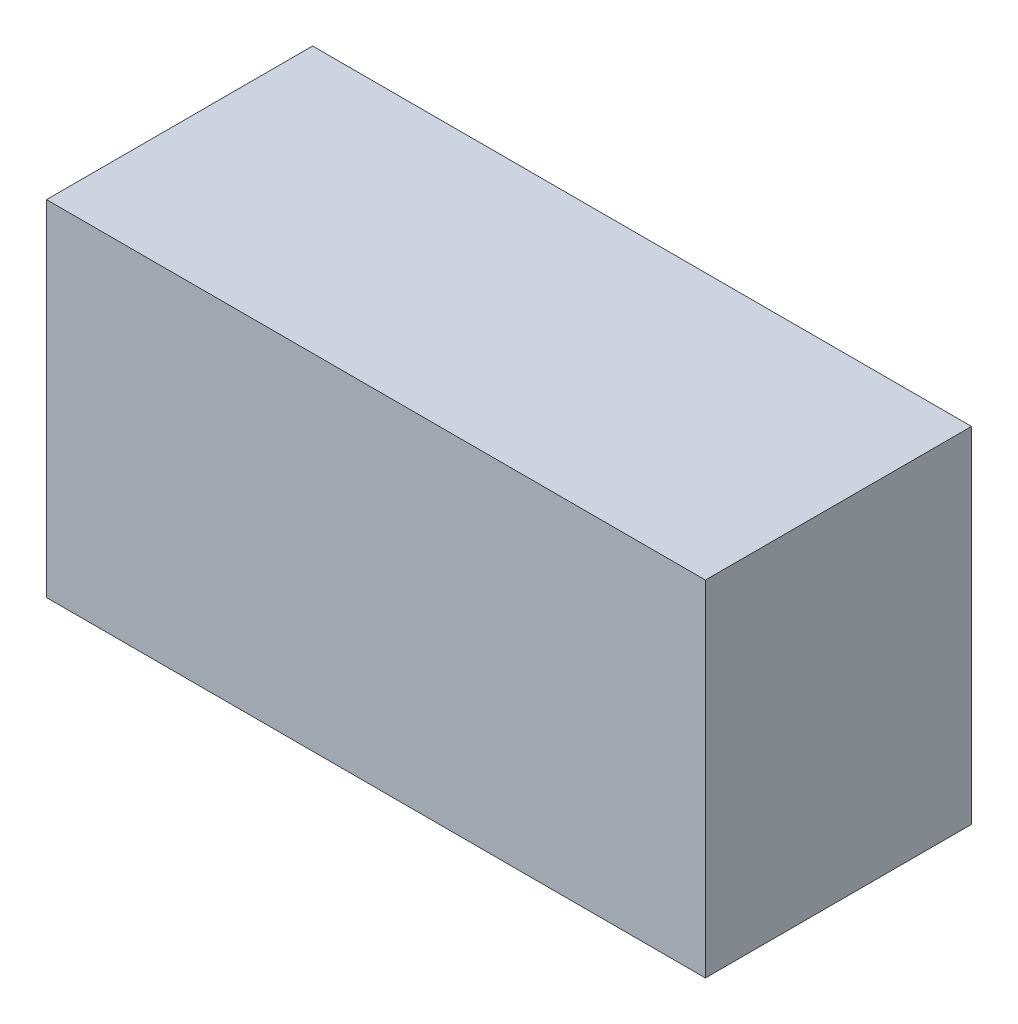
ISO-10303-21;
HEADER;
FILE_DESCRIPTION(('STEP AP214'),'2;1');
FILE_NAME('part.step','',(''),(''),'','','');
FILE_SCHEMA(('AUTOMOTIVE_DESIGN { 1 0 10303 214 1 1 1 1 }'));
ENDSEC;
DATA;
#1=APPLICATION_CONTEXT('core data for automotive mechanical design processes');
#2=APPLICATION_PROTOCOL_DEFINITION('international standard','automotive_design',2000,#1);
#3=PRODUCT_CONTEXT('',#1,'mechanical');
#4=PRODUCT('Part','Part','',(#3));
#5=PRODUCT_RELATED_PRODUCT_CATEGORY('part','',(#4));
#6=PRODUCT_DEFINITION_FORMATION('','',#4);
#7=PRODUCT_DEFINITION_CONTEXT('part definition',#1,'design');
#8=PRODUCT_DEFINITION('design','',#6,#7);
#9=PRODUCT_DEFINITION_SHAPE('','',#8);
#10=(LENGTH_UNIT() NAMED_UNIT(*) SI_UNIT(.MILLI.,.METRE.));
#11=(NAMED_UNIT(*) PLANE_ANGLE_UNIT() SI_UNIT($,.RADIAN.));
#12=(NAMED_UNIT(*) SI_UNIT($,.STERADIAN.) SOLID_ANGLE_UNIT());
#13=UNCERTAINTY_MEASURE_WITH_UNIT(LENGTH_MEASURE(1.E-05),#10,'distance_accuracy_value','');
#14=(GEOMETRIC_REPRESENTATION_CONTEXT(3) GLOBAL_UNCERTAINTY_ASSIGNED_CONTEXT((#13)) GLOBAL_UNIT_ASSIGNED_CONTEXT((#10,
#11,#12)) REPRESENTATION_CONTEXT('',''));
#15=CARTESIAN_POINT('',(0.,0.,0.));
#16=DIRECTION('',(0.,0.,1.));
#17=DIRECTION('',(1.,0.,0.));
#18=AXIS2_PLACEMENT_3D('',#15,#16,#17);
#19=CARTESIAN_POINT('',(-0.3144901,0.16449294,0.));
#20=DIRECTION('',(1.,0.,0.));
#21=DIRECTION('',(0.,-1.,0.));
#22=AXIS2_PLACEMENT_3D('',#19,#20,#21);
#23=PLANE('',#22);
#24=DIRECTION('',(0.,-1.,0.));
#25=VECTOR('',#24,1.);
#26=CARTESIAN_POINT('',(-0.3144901,0.16449294,0.));
#27=LINE('',#26,#25);
#28=CARTESIAN_POINT('',(-0.3144901,0.16449294,0.));
#29=VERTEX_POINT('',#28);
#30=CARTESIAN_POINT('',(-0.3144901,-0.16449294,0.));
#31=VERTEX_POINT('',#30);
#32=EDGE_CURVE('E11',#29,#31,#27,.T.);
#33=ORIENTED_EDGE('',*,*,#32,.T.);
#34=DIRECTION('',(0.,0.,1.));
#35=VECTOR('',#34,1.);
#36=CARTESIAN_POINT('',(-0.3144901,-0.16449294,0.));
#37=LINE('',#36,#35);
#38=CARTESIAN_POINT('',(-0.3144901,-0.16449294,0.254));
#39=VERTEX_POINT('',#38);
#40=EDGE_CURVE('E24',#31,#39,#37,.T.);
#41=ORIENTED_EDGE('',*,*,#40,.T.);
#42=DIRECTION('',(0.,-1.,0.));
#43=VECTOR('',#42,1.);
#44=CARTESIAN_POINT('',(-0.3144901,0.16449294,0.254));
#45=LINE('',#44,#43);
#46=CARTESIAN_POINT('',(-0.3144901,0.16449294,0.254));
#47=VERTEX_POINT('',#46);
#48=EDGE_CURVE('E87',#47,#39,#45,.T.);
#49=ORIENTED_EDGE('',*,*,#48,.F.);
#50=DIRECTION('',(0.,0.,1.));
#51=VECTOR('',#50,1.);
#52=CARTESIAN_POINT('',(-0.3144901,0.16449294,0.));
#53=LINE('',#52,#51);
#54=EDGE_CURVE('E36',#29,#47,#53,.T.);
#55=ORIENTED_EDGE('',*,*,#54,.F.);
#56=EDGE_LOOP('',(#33,#41,#49,#55));
#57=FACE_BOUND('',#56,.T.);
#58=ADVANCED_FACE('F17',(#57),#23,.F.);
#59=CARTESIAN_POINT('',(-0.3144901,-0.16449294,0.));
#60=DIRECTION('',(0.,1.,0.));
#61=DIRECTION('',(1.,0.,0.));
#62=AXIS2_PLACEMENT_3D('',#59,#60,#61);
#63=PLANE('',#62);
#64=DIRECTION('',(1.,0.,0.));
#65=VECTOR('',#64,1.);
#66=CARTESIAN_POINT('',(-0.3144901,-0.16449294,0.));
#67=LINE('',#66,#65);
#68=CARTESIAN_POINT('',(0.31449264,-0.16449294,0.));
#69=VERTEX_POINT('',#68);
#70=EDGE_CURVE('E84',#31,#69,#67,.T.);
#71=ORIENTED_EDGE('',*,*,#70,.T.);
#72=DIRECTION('',(0.,0.,1.));
#73=VECTOR('',#72,1.);
#74=CARTESIAN_POINT('',(0.31449264,-0.16449294,0.));
#75=LINE('',#74,#73);
#76=CARTESIAN_POINT('',(0.31449264,-0.16449294,0.254));
#77=VERTEX_POINT('',#76);
#78=EDGE_CURVE('E82',#69,#77,#75,.T.);
#79=ORIENTED_EDGE('',*,*,#78,.T.);
#80=DIRECTION('',(1.,0.,0.));
#81=VECTOR('',#80,1.);
#82=CARTESIAN_POINT('',(-0.3144901,-0.16449294,0.254));
#83=LINE('',#82,#81);
#84=EDGE_CURVE('E62',#39,#77,#83,.T.);
#85=ORIENTED_EDGE('',*,*,#84,.F.);
#86=ORIENTED_EDGE('',*,*,#40,.F.);
#87=EDGE_LOOP('',(#71,#79,#85,#86));
#88=FACE_BOUND('',#87,.T.);
#89=ADVANCED_FACE('F89',(#88),#63,.F.);
#90=CARTESIAN_POINT('',(0.31449264,-0.16449294,0.));
#91=DIRECTION('',(-1.,0.,0.));
#92=DIRECTION('',(0.,1.,0.));
#93=AXIS2_PLACEMENT_3D('',#90,#91,#92);
#94=PLANE('',#93);
#95=DIRECTION('',(0.,1.,0.));
#96=VECTOR('',#95,1.);
#97=CARTESIAN_POINT('',(0.31449264,-0.16449294,0.));
#98=LINE('',#97,#96);
#99=CARTESIAN_POINT('',(0.31449264,0.16449294,0.));
#100=VERTEX_POINT('',#99);
#101=EDGE_CURVE('E71',#69,#100,#98,.T.);
#102=ORIENTED_EDGE('',*,*,#101,.T.);
#103=DIRECTION('',(0.,0.,1.));
#104=VECTOR('',#103,1.);
#105=CARTESIAN_POINT('',(0.31449264,0.16449294,0.));
#106=LINE('',#105,#104);
#107=CARTESIAN_POINT('',(0.31449264,0.16449294,0.254));
#108=VERTEX_POINT('',#107);
#109=EDGE_CURVE('E65',#100,#108,#106,.T.);
#110=ORIENTED_EDGE('',*,*,#109,.T.);
#111=DIRECTION('',(0.,1.,0.));
#112=VECTOR('',#111,1.);
#113=CARTESIAN_POINT('',(0.31449264,-0.16449294,0.254));
#114=LINE('',#113,#112);
#115=EDGE_CURVE('E57',#77,#108,#114,.T.);
#116=ORIENTED_EDGE('',*,*,#115,.F.);
#117=ORIENTED_EDGE('',*,*,#78,.F.);
#118=EDGE_LOOP('',(#102,#110,#116,#117));
#119=FACE_BOUND('',#118,.T.);
#120=ADVANCED_FACE('F69',(#119),#94,.F.);
#121=CARTESIAN_POINT('',(0.31449264,0.16449294,0.));
#122=DIRECTION('',(0.,-1.,0.));
#123=DIRECTION('',(-1.,0.,0.));
#124=AXIS2_PLACEMENT_3D('',#121,#122,#123);
#125=PLANE('',#124);
#126=DIRECTION('',(-1.,0.,0.));
#127=VECTOR('',#126,1.);
#128=CARTESIAN_POINT('',(0.31449264,0.16449294,0.));
#129=LINE('',#128,#127);
#130=EDGE_CURVE('E66',#100,#29,#129,.T.);
#131=ORIENTED_EDGE('',*,*,#130,.T.);
#132=ORIENTED_EDGE('',*,*,#54,.T.);
#133=DIRECTION('',(-1.,0.,0.));
#134=VECTOR('',#133,1.);
#135=CARTESIAN_POINT('',(0.31449264,0.16449294,0.254));
#136=LINE('',#135,#134);
#137=EDGE_CURVE('E61',#108,#47,#136,.T.);
#138=ORIENTED_EDGE('',*,*,#137,.F.);
#139=ORIENTED_EDGE('',*,*,#109,.F.);
#140=EDGE_LOOP('',(#131,#132,#138,#139));
#141=FACE_BOUND('',#140,.T.);
#142=ADVANCED_FACE('F76',(#141),#125,.F.);
#143=CARTESIAN_POINT('',(-0.3144901,0.16449294,0.));
#144=DIRECTION('',(0.,0.,-1.));
#145=DIRECTION('',(-1.,0.,0.));
#146=AXIS2_PLACEMENT_3D('',#143,#144,#145);
#147=PLANE('',#146);
#148=ORIENTED_EDGE('',*,*,#130,.F.);
#149=ORIENTED_EDGE('',*,*,#101,.F.);
#150=ORIENTED_EDGE('',*,*,#70,.F.);
#151=ORIENTED_EDGE('',*,*,#32,.F.);
#152=EDGE_LOOP('',(#148,#149,#150,#151));
#153=FACE_BOUND('',#152,.T.);
#154=ADVANCED_FACE('F91',(#153),#147,.T.);
#155=CARTESIAN_POINT('',(-0.3144901,0.16449294,0.254));
#156=DIRECTION('',(0.,0.,-1.));
#157=DIRECTION('',(-1.,0.,0.));
#158=AXIS2_PLACEMENT_3D('',#155,#156,#157);
#159=PLANE('',#158);
#160=ORIENTED_EDGE('',*,*,#48,.T.);
#161=ORIENTED_EDGE('',*,*,#84,.T.);
#162=ORIENTED_EDGE('',*,*,#115,.T.);
#163=ORIENTED_EDGE('',*,*,#137,.T.);
#164=EDGE_LOOP('',(#160,#161,#162,#163));
#165=FACE_BOUND('',#164,.T.);
#166=ADVANCED_FACE('F59',(#165),#159,.F.);
#167=CLOSED_SHELL('',(#58,#89,#120,#142,#154,#166));
#168=MANIFOLD_SOLID_BREP('B1',#167);
#169=ADVANCED_BREP_SHAPE_REPRESENTATION('',(#18,#168),#14);
#170=SHAPE_DEFINITION_REPRESENTATION(#9,#169);
ENDSEC;
END-ISO-10303-21;
